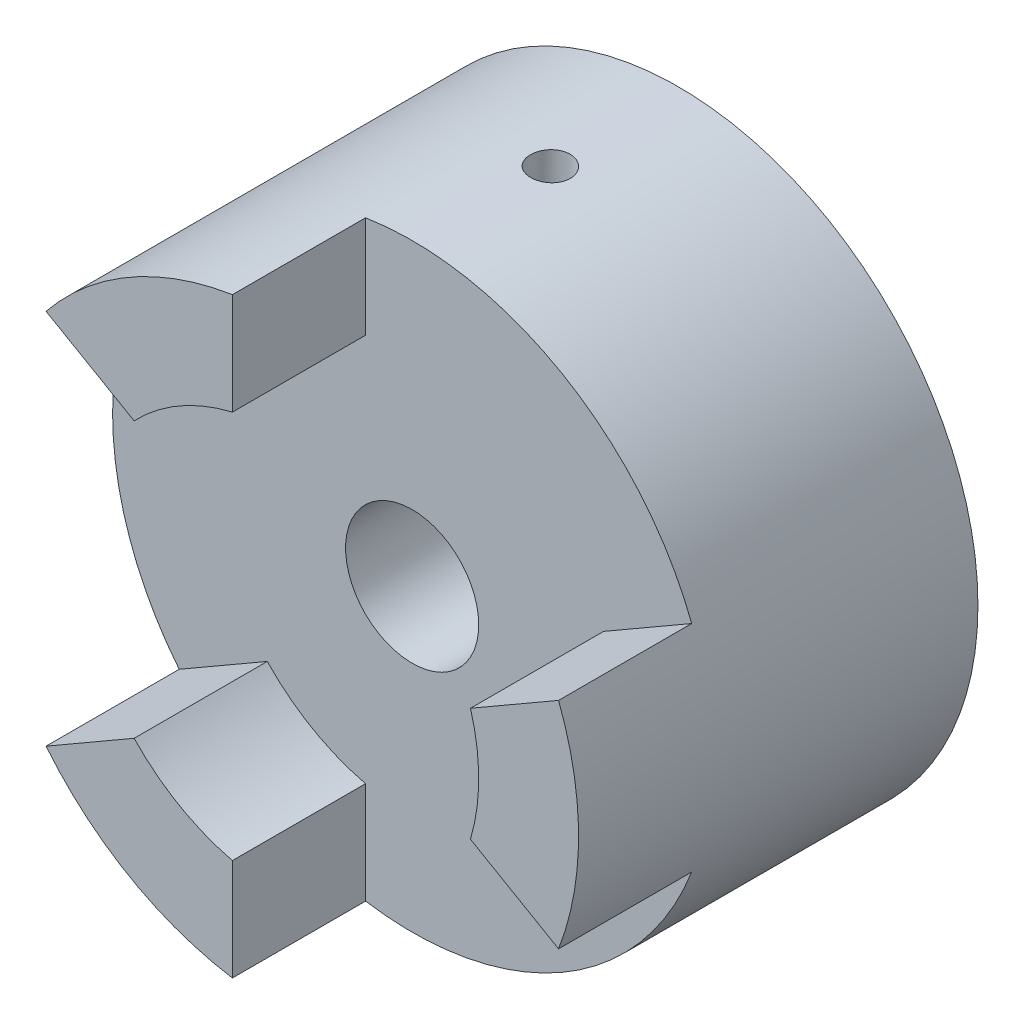
ISO-10303-21;
HEADER;
FILE_DESCRIPTION(('STEP AP214'),'2;1');
FILE_NAME('part.step','',(''),(''),'','','');
FILE_SCHEMA(('AUTOMOTIVE_DESIGN { 1 0 10303 214 1 1 1 1 }'));
ENDSEC;
DATA;
#1=APPLICATION_CONTEXT('core data for automotive mechanical design processes');
#2=APPLICATION_PROTOCOL_DEFINITION('international standard','automotive_design',2000,#1);
#3=PRODUCT_CONTEXT('',#1,'mechanical');
#4=PRODUCT('Part','Part','',(#3));
#5=PRODUCT_RELATED_PRODUCT_CATEGORY('part','',(#4));
#6=PRODUCT_DEFINITION_FORMATION('','',#4);
#7=PRODUCT_DEFINITION_CONTEXT('part definition',#1,'design');
#8=PRODUCT_DEFINITION('design','',#6,#7);
#9=PRODUCT_DEFINITION_SHAPE('','',#8);
#10=(LENGTH_UNIT() NAMED_UNIT(*) SI_UNIT(.MILLI.,.METRE.));
#11=(NAMED_UNIT(*) PLANE_ANGLE_UNIT() SI_UNIT($,.RADIAN.));
#12=(NAMED_UNIT(*) SI_UNIT($,.STERADIAN.) SOLID_ANGLE_UNIT());
#13=UNCERTAINTY_MEASURE_WITH_UNIT(LENGTH_MEASURE(1.E-05),#10,'distance_accuracy_value','');
#14=(GEOMETRIC_REPRESENTATION_CONTEXT(3) GLOBAL_UNCERTAINTY_ASSIGNED_CONTEXT((#13)) GLOBAL_UNIT_ASSIGNED_CONTEXT((#10,
#11,#12)) REPRESENTATION_CONTEXT('',''));
#15=CARTESIAN_POINT('',(0.,0.,0.));
#16=DIRECTION('',(0.,0.,1.));
#17=DIRECTION('',(1.,0.,0.));
#18=AXIS2_PLACEMENT_3D('',#15,#16,#17);
#19=CARTESIAN_POINT('',(0.,0.,20.));
#20=DIRECTION('',(0.,0.,1.));
#21=DIRECTION('',(1.,0.,0.));
#22=AXIS2_PLACEMENT_3D('',#19,#20,#21);
#23=PLANE('',#22);
#24=CARTESIAN_POINT('',(0.,0.,20.));
#25=DIRECTION('',(0.,0.,1.));
#26=DIRECTION('',(1.,0.,0.));
#27=AXIS2_PLACEMENT_3D('',#24,#25,#26);
#28=CIRCLE('',#27,5.);
#29=CARTESIAN_POINT('',(5.,0.,20.));
#30=VERTEX_POINT('',#29);
#31=EDGE_CURVE('E244',#30,#30,#28,.T.);
#32=ORIENTED_EDGE('',*,*,#31,.F.);
#33=EDGE_LOOP('',(#32));
#34=FACE_BOUND('',#33,.T.);
#35=CARTESIAN_POINT('',(0.,0.,20.));
#36=DIRECTION('',(0.,0.,-1.));
#37=DIRECTION('',(1.,0.,0.));
#38=AXIS2_PLACEMENT_3D('',#35,#36,#37);
#39=CIRCLE('',#38,15.);
#40=CARTESIAN_POINT('',(-3.5,-14.5859521458148,20.));
#41=VERTEX_POINT('',#40);
#42=CARTESIAN_POINT('',(-10.8818050966599,-10.3240649861528,20.));
#43=VERTEX_POINT('',#42);
#44=EDGE_CURVE('E53',#41,#43,#39,.T.);
#45=ORIENTED_EDGE('',*,*,#44,.F.);
#46=DIRECTION('',(0.,1.,0.));
#47=VECTOR('',#46,1.);
#48=CARTESIAN_POINT('',(-3.5,-14.5859521458148,20.));
#49=LINE('',#48,#47);
#50=CARTESIAN_POINT('',(-3.5,-22.2261107708929,20.));
#51=VERTEX_POINT('',#50);
#52=EDGE_CURVE('E402',#51,#41,#49,.T.);
#53=ORIENTED_EDGE('',*,*,#52,.F.);
#54=CARTESIAN_POINT('',(0.,0.,20.));
#55=DIRECTION('',(0.,0.,1.));
#56=DIRECTION('',(1.,0.,0.));
#57=AXIS2_PLACEMENT_3D('',#54,#55,#56);
#58=CIRCLE('',#57,22.5);
#59=CARTESIAN_POINT('',(20.9983765549201,-8.081966472201,20.));
#60=VERTEX_POINT('',#59);
#61=EDGE_CURVE('E39',#51,#60,#58,.T.);
#62=ORIENTED_EDGE('',*,*,#61,.T.);
#63=DIRECTION('',(0.866025403784436,-0.500000000000004,0.));
#64=VECTOR('',#63,1.);
#65=CARTESIAN_POINT('',(20.9983765549201,-8.081966472201,20.));
#66=LINE('',#65,#64);
#67=CARTESIAN_POINT('',(14.3818050966598,-4.26188715966194,20.));
#68=VERTEX_POINT('',#67);
#69=EDGE_CURVE('E161',#68,#60,#66,.T.);
#70=ORIENTED_EDGE('',*,*,#69,.F.);
#71=CARTESIAN_POINT('',(0.,0.,20.));
#72=DIRECTION('',(0.,0.,-1.));
#73=DIRECTION('',(1.,0.,0.));
#74=AXIS2_PLACEMENT_3D('',#71,#72,#73);
#75=CIRCLE('',#74,15.);
#76=CARTESIAN_POINT('',(14.3818050966598,4.26188715966176,20.));
#77=VERTEX_POINT('',#76);
#78=EDGE_CURVE('E151',#77,#68,#75,.T.);
#79=ORIENTED_EDGE('',*,*,#78,.F.);
#80=DIRECTION('',(-0.866025403784443,-0.499999999999992,0.));
#81=VECTOR('',#80,1.);
#82=CARTESIAN_POINT('',(14.3818050966598,4.26188715966176,20.));
#83=LINE('',#82,#81);
#84=CARTESIAN_POINT('',(20.9983765549202,8.08196647220072,20.));
#85=VERTEX_POINT('',#84);
#86=EDGE_CURVE('E149',#85,#77,#83,.T.);
#87=ORIENTED_EDGE('',*,*,#86,.F.);
#88=CARTESIAN_POINT('',(-3.50000000000001,22.2261107708929,20.));
#89=VERTEX_POINT('',#88);
#90=EDGE_CURVE('E216',#85,#89,#58,.T.);
#91=ORIENTED_EDGE('',*,*,#90,.T.);
#92=DIRECTION('',(0.,1.,0.));
#93=VECTOR('',#92,1.);
#94=CARTESIAN_POINT('',(-3.5,22.2261107708929,20.));
#95=LINE('',#94,#93);
#96=CARTESIAN_POINT('',(-3.5,14.5859521458148,20.));
#97=VERTEX_POINT('',#96);
#98=EDGE_CURVE('E194',#97,#89,#95,.T.);
#99=ORIENTED_EDGE('',*,*,#98,.F.);
#100=CARTESIAN_POINT('',(0.,0.,20.));
#101=DIRECTION('',(0.,0.,-1.));
#102=DIRECTION('',(1.,0.,0.));
#103=AXIS2_PLACEMENT_3D('',#100,#101,#102);
#104=CIRCLE('',#103,15.);
#105=CARTESIAN_POINT('',(-10.8818050966597,10.324064986153,20.));
#106=VERTEX_POINT('',#105);
#107=EDGE_CURVE('E180',#106,#97,#104,.T.);
#108=ORIENTED_EDGE('',*,*,#107,.F.);
#109=DIRECTION('',(0.866025403784436,-0.500000000000004,0.));
#110=VECTOR('',#109,1.);
#111=CARTESIAN_POINT('',(-17.4983765549201,14.1441442986921,20.));
#112=LINE('',#111,#110);
#113=CARTESIAN_POINT('',(-17.4983765549201,14.144144298692,20.));
#114=VERTEX_POINT('',#113);
#115=EDGE_CURVE('E185',#114,#106,#112,.T.);
#116=ORIENTED_EDGE('',*,*,#115,.F.);
#117=CARTESIAN_POINT('',(-17.4983765549203,-14.1441442986918,20.));
#118=VERTEX_POINT('',#117);
#119=EDGE_CURVE('E45',#114,#118,#58,.T.);
#120=ORIENTED_EDGE('',*,*,#119,.T.);
#121=DIRECTION('',(-0.866025403784443,-0.499999999999992,0.));
#122=VECTOR('',#121,1.);
#123=CARTESIAN_POINT('',(-17.4983765549203,-14.1441442986918,20.));
#124=LINE('',#123,#122);
#125=EDGE_CURVE('E58',#43,#118,#124,.T.);
#126=ORIENTED_EDGE('',*,*,#125,.F.);
#127=EDGE_LOOP('',(#45,#53,#62,#70,#79,#87,#91,#99,#108,#116,#120,#126));
#128=FACE_BOUND('',#127,.T.);
#129=ADVANCED_FACE('F34',(#34,#128),#23,.T.);
#130=CARTESIAN_POINT('',(0.,0.,20.));
#131=DIRECTION('',(0.,0.,-1.));
#132=DIRECTION('',(-1.,0.,0.));
#133=AXIS2_PLACEMENT_3D('',#130,#131,#132);
#134=CYLINDRICAL_SURFACE('',#133,22.5);
#135=CARTESIAN_POINT('',(-1.16795072214175,22.4696660213419,9.9509839765561));
#136=CARTESIAN_POINT('',(-1.16794701412822,22.4696666351266,9.86682882468708));
#137=CARTESIAN_POINT('',(-1.16083853462614,22.4700392018296,9.78261503637612));
#138=CARTESIAN_POINT('',(-1.13258449434566,22.471480697484,9.61651364954389));
#139=CARTESIAN_POINT('',(-1.11142267175415,22.4725504331371,9.5346288606282));
#140=CARTESIAN_POINT('',(-1.05567496758904,22.4752380311045,9.37561546316127));
#141=CARTESIAN_POINT('',(-1.02109626483874,22.4768556002368,9.29848433665232));
#142=CARTESIAN_POINT('',(-0.939510841472762,22.4804132200468,9.15113626091315));
#143=CARTESIAN_POINT('',(-0.892506933100566,22.4823531977157,9.08091775205354));
#144=CARTESIAN_POINT('',(-0.787321799091392,22.4862822653723,8.9492495333017));
#145=CARTESIAN_POINT('',(-0.729123980123893,22.488271424401,8.88781308018272));
#146=CARTESIAN_POINT('',(-0.603241089186681,22.4919998434333,8.77556647860183));
#147=CARTESIAN_POINT('',(-0.535555618423458,22.4937390929262,8.72475677703693));
#148=CARTESIAN_POINT('',(-0.392546510837813,22.4966890716028,8.63516458913433));
#149=CARTESIAN_POINT('',(-0.317215933429358,22.4978993151447,8.59639316367709));
#150=CARTESIAN_POINT('',(-0.161106583630494,22.4995584749486,8.53204891038463));
#151=CARTESIAN_POINT('',(-0.0803278761180135,22.500007400275,8.50647592540988));
#152=CARTESIAN_POINT('',(0.0842541461032171,22.4999924287302,8.46929151286395));
#153=CARTESIAN_POINT('',(0.168052740501643,22.499529900542,8.4576591934942));
#154=CARTESIAN_POINT('',(0.336402293717323,22.4976425119387,8.44862178180597));
#155=CARTESIAN_POINT('',(0.420953243062837,22.4962176636219,8.45121651062898));
#156=CARTESIAN_POINT('',(0.588266129708601,22.4924639826339,8.47054233443924));
#157=CARTESIAN_POINT('',(0.67103069653389,22.4901365901524,8.48725095768299));
#158=CARTESIAN_POINT('',(0.832565993292586,22.4847363612551,8.53429538928928));
#159=CARTESIAN_POINT('',(0.911336697020258,22.4816635199487,8.56463128705432));
#160=CARTESIAN_POINT('',(1.06272261164742,22.4750166272793,8.63809451797387));
#161=CARTESIAN_POINT('',(1.13533287297505,22.4714421789089,8.6812320136648));
#162=CARTESIAN_POINT('',(1.2722859030292,22.4641046836031,8.77906653524814));
#163=CARTESIAN_POINT('',(1.33662856545644,22.4603416342438,8.83376370974329));
#164=CARTESIAN_POINT('',(1.45535453244866,22.4529618562286,8.95329180612418));
#165=CARTESIAN_POINT('',(1.50971821721403,22.449345426488,9.01814223651269));
#166=CARTESIAN_POINT('',(1.60679530484671,22.4426064521477,9.15606769541081));
#167=CARTESIAN_POINT('',(1.64950870236193,22.439483907775,9.22914272769877));
#168=CARTESIAN_POINT('',(1.7220745704774,22.4340319588832,9.38145576222379));
#169=CARTESIAN_POINT('',(1.75192618133141,22.4317026073872,9.46069417603434));
#170=CARTESIAN_POINT('',(1.79790975507206,22.4280640531212,9.62307881670943));
#171=CARTESIAN_POINT('',(1.81404190173043,22.4267548366865,9.7062249912139));
#172=CARTESIAN_POINT('',(1.83210546711131,22.4252864697945,9.87389368251136));
#173=CARTESIAN_POINT('',(1.83406414738777,22.4251251115319,9.95841324354472));
#174=CARTESIAN_POINT('',(1.82379660597111,22.4259624418472,10.1265800340995));
#175=CARTESIAN_POINT('',(1.81157046841159,22.4269611235448,10.2102272687919));
#176=CARTESIAN_POINT('',(1.77330198524295,22.430019264112,10.3741975858724));
#177=CARTESIAN_POINT('',(1.74727222536644,22.432077756628,10.4545236246261));
#178=CARTESIAN_POINT('',(1.68214605935868,22.4370551772429,10.60966269689));
#179=CARTESIAN_POINT('',(1.64304951843054,22.4399741142182,10.6844756735177));
#180=CARTESIAN_POINT('',(1.5528271333128,22.4463976750895,10.8265902326363));
#181=CARTESIAN_POINT('',(1.50168303140065,22.4499031855614,10.8938801836915));
#182=CARTESIAN_POINT('',(1.38884040962061,22.4571661269891,11.0189213375547));
#183=CARTESIAN_POINT('',(1.3271417726129,22.4609235607405,11.0766724344814));
#184=CARTESIAN_POINT('',(1.19482048170147,22.4683509312009,11.1810888947149));
#185=CARTESIAN_POINT('',(1.1241838714648,22.4720207201659,11.2277365849532));
#186=CARTESIAN_POINT('',(0.976058442943612,22.4789412520019,11.3085010832813));
#187=CARTESIAN_POINT('',(0.89856967163721,22.4821919977453,11.3426179772733));
#188=CARTESIAN_POINT('',(0.739001568444851,22.4880021362221,11.3973217571046));
#189=CARTESIAN_POINT('',(0.656926076696509,22.4905620971359,11.4179197825061));
#190=CARTESIAN_POINT('',(0.49045958171309,22.4948078152173,11.445037570028));
#191=CARTESIAN_POINT('',(0.40606860499338,22.4964935823911,11.4515574932931));
#192=CARTESIAN_POINT('',(0.237540917170963,22.4989035911875,11.4503323899263));
#193=CARTESIAN_POINT('',(0.153404030342545,22.4996296909851,11.4426150002337));
#194=CARTESIAN_POINT('',(-0.0123898446146695,22.5001493640251,11.4131917004924));
#195=CARTESIAN_POINT('',(-0.094046828527573,22.4999429356823,11.3914857666642));
#196=CARTESIAN_POINT('',(-0.252564896325961,22.4987221590962,11.3347079254833));
#197=CARTESIAN_POINT('',(-0.329426048193699,22.4977078223081,11.2996362076445));
#198=CARTESIAN_POINT('',(-0.476181328642586,22.4950804526772,11.2171260186757));
#199=CARTESIAN_POINT('',(-0.546075625279928,22.4934674342804,11.1696878459523));
#200=CARTESIAN_POINT('',(-0.677050473510534,22.4899068565662,11.0636887007921));
#201=CARTESIAN_POINT('',(-0.738114734161111,22.4879586930601,11.0051076197651));
#202=CARTESIAN_POINT('',(-0.849564286877072,22.4840245335145,10.8785150339242));
#203=CARTESIAN_POINT('',(-0.899946966889859,22.4820385283505,10.8105012291612));
#204=CARTESIAN_POINT('',(-0.9886424430826,22.47831322808,10.666886676364));
#205=CARTESIAN_POINT('',(-1.02693884290122,22.4765742698621,10.5912758037275));
#206=CARTESIAN_POINT('',(-1.09023738754139,22.47359330319,10.4347413302532));
#207=CARTESIAN_POINT('',(-1.11525505244659,22.4723507150045,10.3538240563899));
#208=CARTESIAN_POINT('',(-1.14480459317688,22.4708599339827,10.2188429666264));
#209=CARTESIAN_POINT('',(-1.15347308513632,22.4704146367155,10.165650945378));
#210=CARTESIAN_POINT('',(-1.16504733114898,22.4698174842866,10.0586419413207));
#211=CARTESIAN_POINT('',(-1.16795309446345,22.4696656286533,10.0048249595162));
#212=CARTESIAN_POINT('',(-1.16795072214175,22.4696660213419,9.9509839765561));
#213=B_SPLINE_CURVE_WITH_KNOTS('',3,(#135,#136,#137,#138,#139,#140,#141,#142,#143,#144,#145,
#146,#147,#148,#149,#150,#151,#152,#153,#154,#155,#156,#157,#158,#159,#160,#161,#162,#163,#164,
#165,#166,#167,#168,#169,#170,#171,#172,#173,#174,#175,#176,#177,#178,#179,#180,#181,#182,#183,
#184,#185,#186,#187,#188,#189,#190,#191,#192,#193,#194,#195,#196,#197,#198,#199,#200,#201,#202,
#203,#204,#205,#206,#207,#208,#209,#210,#211,#212),.UNSPECIFIED.,.T.,.F.,(4,2,2,2,2,2,2,2,2,2,2,
2,2,2,2,2,2,2,2,2,2,2,2,2,2,2,2,2,2,2,2,2,2,2,2,2,2,2,4),(0.,0.252268897261408,
0.504830217080159,0.757256587612157,1.0096258743797,1.26237218560875,1.51512912368541,
1.76811761462682,2.02110309343897,2.27370896646024,2.52631166379775,2.7785129306925,
3.03071585219184,3.28311952276676,3.53552643825509,3.78842441965064,4.04132251722657,
4.2942375171565,4.54714912924566,4.7995741560111,5.05199768558994,5.30419145760964,
5.55638783133998,5.80896888837173,6.06155274886383,6.31453599310349,6.567517503036,
6.82029029333925,7.07306019026671,7.32533993592649,7.57762011044376,7.82989670800653,
8.0821672186178,8.33489737367269,8.58768925975639,8.84082262604519,9.09365947683888,
9.25505693053532,9.41645412485044),.UNSPECIFIED.);
#214=CARTESIAN_POINT('',(-1.16795072214175,22.4696660213419,9.9509839765561));
#215=VERTEX_POINT('',#214);
#216=EDGE_CURVE('E11',#215,#215,#213,.T.);
#217=ORIENTED_EDGE('',*,*,#216,.T.);
#218=EDGE_LOOP('',(#217));
#219=FACE_BOUND('',#218,.T.);
#220=ORIENTED_EDGE('',*,*,#119,.F.);
#221=DIRECTION('',(0.,0.,-1.));
#222=VECTOR('',#221,1.);
#223=CARTESIAN_POINT('',(-17.4983765549201,14.1441442986921,30.));
#224=LINE('',#223,#222);
#225=CARTESIAN_POINT('',(-17.4983765549201,14.1441442986921,30.));
#226=VERTEX_POINT('',#225);
#227=EDGE_CURVE('E206',#226,#114,#224,.T.);
#228=ORIENTED_EDGE('',*,*,#227,.F.);
#229=CARTESIAN_POINT('',(0.,0.,30.));
#230=DIRECTION('',(0.,0.,1.));
#231=DIRECTION('',(1.,0.,0.));
#232=AXIS2_PLACEMENT_3D('',#229,#230,#231);
#233=CIRCLE('',#232,22.5);
#234=CARTESIAN_POINT('',(-3.50000000000001,22.2261107708929,30.));
#235=VERTEX_POINT('',#234);
#236=EDGE_CURVE('E187',#235,#226,#233,.T.);
#237=ORIENTED_EDGE('',*,*,#236,.F.);
#238=DIRECTION('',(0.,0.,-1.));
#239=VECTOR('',#238,1.);
#240=CARTESIAN_POINT('',(-3.50000000000001,22.2261107708929,30.));
#241=LINE('',#240,#239);
#242=EDGE_CURVE('E202',#235,#89,#241,.T.);
#243=ORIENTED_EDGE('',*,*,#242,.T.);
#244=ORIENTED_EDGE('',*,*,#90,.F.);
#245=DIRECTION('',(0.,0.,-1.));
#246=VECTOR('',#245,1.);
#247=CARTESIAN_POINT('',(20.9983765549202,8.08196647220072,30.));
#248=LINE('',#247,#246);
#249=CARTESIAN_POINT('',(20.9983765549202,8.08196647220072,30.));
#250=VERTEX_POINT('',#249);
#251=EDGE_CURVE('E178',#250,#85,#248,.T.);
#252=ORIENTED_EDGE('',*,*,#251,.F.);
#253=CARTESIAN_POINT('',(0.,0.,30.));
#254=DIRECTION('',(0.,0.,1.));
#255=DIRECTION('',(1.,0.,0.));
#256=AXIS2_PLACEMENT_3D('',#253,#254,#255);
#257=CIRCLE('',#256,22.5);
#258=CARTESIAN_POINT('',(20.9983765549201,-8.081966472201,30.));
#259=VERTEX_POINT('',#258);
#260=EDGE_CURVE('E157',#259,#250,#257,.T.);
#261=ORIENTED_EDGE('',*,*,#260,.F.);
#262=DIRECTION('',(0.,0.,-1.));
#263=VECTOR('',#262,1.);
#264=CARTESIAN_POINT('',(20.9983765549201,-8.081966472201,30.));
#265=LINE('',#264,#263);
#266=EDGE_CURVE('E166',#259,#60,#265,.T.);
#267=ORIENTED_EDGE('',*,*,#266,.T.);
#268=ORIENTED_EDGE('',*,*,#61,.F.);
#269=DIRECTION('',(0.,0.,-1.));
#270=VECTOR('',#269,1.);
#271=CARTESIAN_POINT('',(-3.5,-22.2261107708929,30.));
#272=LINE('',#271,#270);
#273=CARTESIAN_POINT('',(-3.5,-22.2261107708929,30.));
#274=VERTEX_POINT('',#273);
#275=EDGE_CURVE('E130',#274,#51,#272,.T.);
#276=ORIENTED_EDGE('',*,*,#275,.F.);
#277=CARTESIAN_POINT('',(0.,0.,30.));
#278=DIRECTION('',(0.,0.,1.));
#279=DIRECTION('',(1.,0.,0.));
#280=AXIS2_PLACEMENT_3D('',#277,#278,#279);
#281=CIRCLE('',#280,22.5);
#282=CARTESIAN_POINT('',(-17.4983765549203,-14.1441442986918,30.));
#283=VERTEX_POINT('',#282);
#284=EDGE_CURVE('E136',#283,#274,#281,.T.);
#285=ORIENTED_EDGE('',*,*,#284,.F.);
#286=DIRECTION('',(0.,0.,-1.));
#287=VECTOR('',#286,1.);
#288=CARTESIAN_POINT('',(-17.4983765549203,-14.1441442986918,30.));
#289=LINE('',#288,#287);
#290=EDGE_CURVE('E394',#283,#118,#289,.T.);
#291=ORIENTED_EDGE('',*,*,#290,.T.);
#292=EDGE_LOOP('',(#220,#228,#237,#243,#244,#252,#261,#267,#268,#276,#285,#291));
#293=FACE_BOUND('',#292,.T.);
#294=CARTESIAN_POINT('',(0.,0.,0.));
#295=DIRECTION('',(0.,0.,1.));
#296=DIRECTION('',(1.,0.,0.));
#297=AXIS2_PLACEMENT_3D('',#294,#295,#296);
#298=CIRCLE('',#297,22.5);
#299=CARTESIAN_POINT('',(22.5,0.,0.));
#300=VERTEX_POINT('',#299);
#301=EDGE_CURVE('E217',#300,#300,#298,.T.);
#302=ORIENTED_EDGE('',*,*,#301,.T.);
#303=EDGE_LOOP('',(#302));
#304=FACE_BOUND('',#303,.T.);
#305=ADVANCED_FACE('F36',(#219,#293,#304),#134,.T.);
#306=CARTESIAN_POINT('',(0.,0.,0.));
#307=DIRECTION('',(0.,0.,1.));
#308=DIRECTION('',(1.,0.,0.));
#309=AXIS2_PLACEMENT_3D('',#306,#307,#308);
#310=PLANE('',#309);
#311=CARTESIAN_POINT('',(0.,0.,0.));
#312=DIRECTION('',(0.,0.,1.));
#313=DIRECTION('',(1.,0.,0.));
#314=AXIS2_PLACEMENT_3D('',#311,#312,#313);
#315=CIRCLE('',#314,5.);
#316=CARTESIAN_POINT('',(5.,0.,0.));
#317=VERTEX_POINT('',#316);
#318=EDGE_CURVE('E246',#317,#317,#315,.F.);
#319=ORIENTED_EDGE('',*,*,#318,.F.);
#320=EDGE_LOOP('',(#319));
#321=FACE_BOUND('',#320,.T.);
#322=ORIENTED_EDGE('',*,*,#301,.F.);
#323=EDGE_LOOP('',(#322));
#324=FACE_BOUND('',#323,.T.);
#325=ADVANCED_FACE('F253',(#321,#324),#310,.F.);
#326=CARTESIAN_POINT('',(0.,0.,-0.001000000000001));
#327=DIRECTION('',(0.,0.,1.));
#328=DIRECTION('',(1.,0.,0.));
#329=AXIS2_PLACEMENT_3D('',#326,#327,#328);
#330=CYLINDRICAL_SURFACE('',#329,5.);
#331=CARTESIAN_POINT('',(-1.42932400055375,4.79134979952842,9.9509839765561));
#332=CARTESIAN_POINT('',(-1.42932296443467,4.79135063448742,10.0331785244985));
#333=CARTESIAN_POINT('',(-1.422514069942,4.7933972446987,10.1153832007001));
#334=CARTESIAN_POINT('',(-1.39553134300934,4.80132109648802,10.277389226148));
#335=CARTESIAN_POINT('',(-1.37535304496598,4.80719961797761,10.3571897630576));
#336=CARTESIAN_POINT('',(-1.32238618351659,4.82203727176339,10.5120187048278));
#337=CARTESIAN_POINT('',(-1.28961859373441,4.83099127771981,10.5870548061892));
#338=CARTESIAN_POINT('',(-1.21248381726078,4.85092400409659,10.7306059105514));
#339=CARTESIAN_POINT('',(-1.16811489409703,4.86190302754638,10.7991199352405));
#340=CARTESIAN_POINT('',(-1.0675477744788,4.88498438250552,10.9298503671335));
#341=CARTESIAN_POINT('',(-1.0110468747201,4.89710989632544,10.9918298745024));
#342=CARTESIAN_POINT('',(-0.888487115072368,4.92082118005726,11.1056219278786));
#343=CARTESIAN_POINT('',(-0.822427028478875,4.93240688044371,11.157433167006));
#344=CARTESIAN_POINT('',(-0.680950025195329,4.95394023252572,11.2504466763894));
#345=CARTESIAN_POINT('',(-0.605367863556551,4.96384905552715,11.2914074009989));
#346=CARTESIAN_POINT('',(-0.448044957831161,4.98051223286052,11.3599712355988));
#347=CARTESIAN_POINT('',(-0.366305546360055,4.98726726750278,11.3875772264135));
#348=CARTESIAN_POINT('',(-0.201479374232686,4.99660102683323,11.4278639776466));
#349=CARTESIAN_POINT('',(-0.118498045762689,4.99929369281833,11.4409491042088));
#350=CARTESIAN_POINT('',(0.0485070418418744,5.00046136727325,11.4531013012025));
#351=CARTESIAN_POINT('',(0.132530578321246,4.99893726166618,11.4521713159581));
#352=CARTESIAN_POINT('',(0.296399951332224,4.9918597630997,11.4365911080131));
#353=CARTESIAN_POINT('',(0.376293615269112,4.98643623839057,11.4223787827462));
#354=CARTESIAN_POINT('',(0.532452976751742,4.97218714201174,11.3813526405618));
#355=CARTESIAN_POINT('',(0.608718444207739,4.96336135490264,11.3545380256134));
#356=CARTESIAN_POINT('',(0.756504219033951,4.94300871447356,11.2887719531375));
#357=CARTESIAN_POINT('',(0.827958913049302,4.93145159874522,11.2496827737488));
#358=CARTESIAN_POINT('',(0.96340874615843,4.90679021133723,11.1605861241279));
#359=CARTESIAN_POINT('',(1.02740210998043,4.89368557294284,11.1105760635926));
#360=CARTESIAN_POINT('',(1.14873162436376,4.86666523213691,10.9987862258045));
#361=CARTESIAN_POINT('',(1.20571605546711,4.85273773775434,10.9366270575264));
#362=CARTESIAN_POINT('',(1.30856428490652,4.8260222226985,10.803473958666));
#363=CARTESIAN_POINT('',(1.35442697810153,4.81323431534312,10.7324791511669));
#364=CARTESIAN_POINT('',(1.43411041449273,4.79010153817037,10.5827445073071));
#365=CARTESIAN_POINT('',(1.4678114682443,4.77978127092383,10.5039369306932));
#366=CARTESIAN_POINT('',(1.52141287306159,4.76299284654933,10.3413767681105));
#367=CARTESIAN_POINT('',(1.54131772627952,4.75652343285911,10.2576258050215));
#368=CARTESIAN_POINT('',(1.56611632224678,4.74841495672667,10.0909016158168));
#369=CARTESIAN_POINT('',(1.57154191657337,4.74660484175629,10.0080157526621));
#370=CARTESIAN_POINT('',(1.56871543902162,4.74753986645395,9.84251107654623));
#371=CARTESIAN_POINT('',(1.56046528176053,4.75028436847167,9.75989222782525));
#372=CARTESIAN_POINT('',(1.53099165063931,4.7598625581268,9.59949559858523));
#373=CARTESIAN_POINT('',(1.51011077430168,4.76658816190334,9.52164781229257));
#374=CARTESIAN_POINT('',(1.45635788792864,4.78328428135765,9.37058228574118));
#375=CARTESIAN_POINT('',(1.42348402644975,4.79325529802753,9.29736526241553));
#376=CARTESIAN_POINT('',(1.34565780909077,4.81569127858406,9.15546651248397));
#377=CARTESIAN_POINT('',(1.30040495091017,4.82821599653718,9.08695925557031));
#378=CARTESIAN_POINT('',(1.19944661599221,4.85428069293403,8.95834587037529));
#379=CARTESIAN_POINT('',(1.14373863739783,4.86782091391589,8.89824175894331));
#380=CARTESIAN_POINT('',(1.02093235225642,4.89507846894722,8.78580357074136));
#381=CARTESIAN_POINT('',(0.953483516674357,4.90878320140967,8.73384834756912));
#382=CARTESIAN_POINT('',(0.810497398955897,4.9344058819619,8.64201727552835));
#383=CARTESIAN_POINT('',(0.734960518759725,4.94632391877202,8.60214082677464));
#384=CARTESIAN_POINT('',(0.578428368637948,4.9670513941462,8.53598394598781));
#385=CARTESIAN_POINT('',(0.497479213717913,4.97588388845392,8.50960196039713));
#386=CARTESIAN_POINT('',(0.331970090537054,4.98965743444545,8.47092305766568));
#387=CARTESIAN_POINT('',(0.247411162563737,4.99459959939399,8.45862211060768));
#388=CARTESIAN_POINT('',(0.080578008585428,5.00002062862095,8.4487609325016));
#389=CARTESIAN_POINT('',(-0.00165879935132662,5.00066404465176,8.45065128114827));
#390=CARTESIAN_POINT('',(-0.1646509927773,4.99795291237101,8.46780560905522));
#391=CARTESIAN_POINT('',(-0.245406461997473,4.99459859073839,8.48306883003654));
#392=CARTESIAN_POINT('',(-0.402293598014275,4.9844036241748,8.52619563795573));
#393=CARTESIAN_POINT('',(-0.478465604846828,4.97760080353909,8.55392215720511));
#394=CARTESIAN_POINT('',(-0.625156726331362,4.9613135110757,8.62106589106329));
#395=CARTESIAN_POINT('',(-0.695674909604077,4.95182859857548,8.66048502684229));
#396=CARTESIAN_POINT('',(-0.831497974724446,4.93087082685218,8.75135743398614));
#397=CARTESIAN_POINT('',(-0.896563846830565,4.91934406965021,8.80315540655687));
#398=CARTESIAN_POINT('',(-1.01727228510547,4.89580907559257,8.9166943648889));
#399=CARTESIAN_POINT('',(-1.07291212765864,4.88380070081067,8.97843821445425));
#400=CARTESIAN_POINT('',(-1.17483948093555,4.86030600083987,9.11232475486661));
#401=CARTESIAN_POINT('',(-1.22079882562873,4.84884590213079,9.18472252994654));
#402=CARTESIAN_POINT('',(-1.29980719863466,4.82826860994361,9.33653915071712));
#403=CARTESIAN_POINT('',(-1.33286243046854,4.81915029140159,9.41595460015729));
#404=CARTESIAN_POINT('',(-1.38213298674558,4.80523583586186,9.57072440816237));
#405=CARTESIAN_POINT('',(-1.39978030734065,4.80007954010927,9.64559262348709));
#406=CARTESIAN_POINT('',(-1.42337512585055,4.7931364693721,9.79729919905187));
#407=CARTESIAN_POINT('',(-1.42932496926096,4.79134901889342,9.87413716120134));
#408=CARTESIAN_POINT('',(-1.42932400055375,4.79134979952842,9.9509839765561));
#409=B_SPLINE_CURVE_WITH_KNOTS('',3,(#331,#332,#333,#334,#335,#336,#337,#338,#339,#340,#341,
#342,#343,#344,#345,#346,#347,#348,#349,#350,#351,#352,#353,#354,#355,#356,#357,#358,#359,#360,
#361,#362,#363,#364,#365,#366,#367,#368,#369,#370,#371,#372,#373,#374,#375,#376,#377,#378,#379,
#380,#381,#382,#383,#384,#385,#386,#387,#388,#389,#390,#391,#392,#393,#394,#395,#396,#397,#398,
#399,#400,#401,#402,#403,#404,#405,#406,#407,#408),.UNSPECIFIED.,.T.,.F.,(4,2,2,2,2,2,2,2,2,2,2,
2,2,2,2,2,2,2,2,2,2,2,2,2,2,2,2,2,2,2,2,2,2,2,2,2,2,2,4),(0.,0.246300165915542,
0.492682641688997,0.738656414466192,0.984667025370099,1.23773150007983,1.49082847871272,
1.74915939273644,2.00743455587876,2.25832140149557,2.50915554101439,2.75200125990879,
2.99486235890375,3.24055209335675,3.48630016590829,3.74152147023276,3.99676812491861,
4.25446238246264,4.51207250628409,4.76008080790307,5.00805439107385,5.24958594938814,
5.49115481045785,5.73920731809386,5.9873192592892,6.24479506100599,6.50225807324199,
6.75775391814322,7.01317662321679,7.25876303911216,7.50433553047751,7.74727096872215,
7.99024634491374,8.24099627054484,8.49181852629886,8.75011639669142,9.0082899396394,
9.23861153857443,9.46888695033555),.UNSPECIFIED.);
#410=CARTESIAN_POINT('',(-1.42932400055375,4.79134979952842,9.9509839765561));
#411=VERTEX_POINT('',#410);
#412=EDGE_CURVE('E239',#411,#411,#409,.T.);
#413=ORIENTED_EDGE('',*,*,#412,.T.);
#414=EDGE_LOOP('',(#413));
#415=FACE_BOUND('',#414,.T.);
#416=ORIENTED_EDGE('',*,*,#31,.T.);
#417=EDGE_LOOP('',(#416));
#418=FACE_BOUND('',#417,.T.);
#419=ORIENTED_EDGE('',*,*,#318,.T.);
#420=EDGE_LOOP('',(#419));
#421=FACE_BOUND('',#420,.T.);
#422=ADVANCED_FACE('F232',(#415,#418,#421),#330,.F.);
#423=CARTESIAN_POINT('',(0.332625348918888,22.4975412073688,9.9509839765561));
#424=DIRECTION('',(0.0147833488408394,0.999890720327502,0.));
#425=DIRECTION('',(-0.999890720327502,0.0147833488408394,0.));
#426=AXIS2_PLACEMENT_3D('',#423,#424,#425);
#427=CYLINDRICAL_SURFACE('',#426,1.49999999999999);
#428=ORIENTED_EDGE('',*,*,#216,.F.);
#429=EDGE_LOOP('',(#428));
#430=FACE_BOUND('',#429,.T.);
#431=ORIENTED_EDGE('',*,*,#412,.F.);
#432=EDGE_LOOP('',(#431));
#433=FACE_BOUND('',#432,.T.);
#434=ADVANCED_FACE('F226',(#430,#433),#427,.F.);
#435=CARTESIAN_POINT('',(0.,0.,30.));
#436=DIRECTION('',(0.,0.,-1.));
#437=DIRECTION('',(-1.,0.,0.));
#438=AXIS2_PLACEMENT_3D('',#435,#436,#437);
#439=CYLINDRICAL_SURFACE('',#438,15.);
#440=ORIENTED_EDGE('',*,*,#107,.T.);
#441=DIRECTION('',(0.,0.,-1.));
#442=VECTOR('',#441,1.);
#443=CARTESIAN_POINT('',(-3.5,14.5859521458148,30.));
#444=LINE('',#443,#442);
#445=CARTESIAN_POINT('',(-3.5,14.5859521458148,30.));
#446=VERTEX_POINT('',#445);
#447=EDGE_CURVE('E205',#446,#97,#444,.T.);
#448=ORIENTED_EDGE('',*,*,#447,.F.);
#449=CARTESIAN_POINT('',(0.,0.,30.));
#450=DIRECTION('',(0.,0.,-1.));
#451=DIRECTION('',(1.,0.,0.));
#452=AXIS2_PLACEMENT_3D('',#449,#450,#451);
#453=CIRCLE('',#452,15.);
#454=CARTESIAN_POINT('',(-10.8818050966597,10.324064986153,30.));
#455=VERTEX_POINT('',#454);
#456=EDGE_CURVE('E181',#455,#446,#453,.T.);
#457=ORIENTED_EDGE('',*,*,#456,.F.);
#458=DIRECTION('',(0.,0.,-1.));
#459=VECTOR('',#458,1.);
#460=CARTESIAN_POINT('',(-10.8818050966597,10.324064986153,30.));
#461=LINE('',#460,#459);
#462=EDGE_CURVE('E191',#455,#106,#461,.T.);
#463=ORIENTED_EDGE('',*,*,#462,.T.);
#464=EDGE_LOOP('',(#440,#448,#457,#463));
#465=FACE_BOUND('',#464,.T.);
#466=ADVANCED_FACE('F231',(#465),#439,.F.);
#467=CARTESIAN_POINT('',(-3.5,22.2261107708929,30.));
#468=DIRECTION('',(-1.,0.,0.));
#469=DIRECTION('',(0.,-1.,0.));
#470=AXIS2_PLACEMENT_3D('',#467,#468,#469);
#471=PLANE('',#470);
#472=ORIENTED_EDGE('',*,*,#98,.T.);
#473=ORIENTED_EDGE('',*,*,#242,.F.);
#474=DIRECTION('',(0.,1.,0.));
#475=VECTOR('',#474,1.);
#476=CARTESIAN_POINT('',(-3.5,22.2261107708929,30.));
#477=LINE('',#476,#475);
#478=EDGE_CURVE('E184',#446,#235,#477,.T.);
#479=ORIENTED_EDGE('',*,*,#478,.F.);
#480=ORIENTED_EDGE('',*,*,#447,.T.);
#481=EDGE_LOOP('',(#472,#473,#479,#480));
#482=FACE_BOUND('',#481,.T.);
#483=ADVANCED_FACE('F285',(#482),#471,.F.);
#484=CARTESIAN_POINT('',(-17.4983765549201,14.1441442986921,30.));
#485=DIRECTION('',(0.500000000000004,0.866025403784436,0.));
#486=DIRECTION('',(-0.866025403784436,0.500000000000004,0.));
#487=AXIS2_PLACEMENT_3D('',#484,#485,#486);
#488=PLANE('',#487);
#489=ORIENTED_EDGE('',*,*,#115,.T.);
#490=ORIENTED_EDGE('',*,*,#462,.F.);
#491=DIRECTION('',(0.866025403784436,-0.500000000000004,0.));
#492=VECTOR('',#491,1.);
#493=CARTESIAN_POINT('',(-17.4983765549201,14.1441442986921,30.));
#494=LINE('',#493,#492);
#495=EDGE_CURVE('E189',#226,#455,#494,.T.);
#496=ORIENTED_EDGE('',*,*,#495,.F.);
#497=ORIENTED_EDGE('',*,*,#227,.T.);
#498=EDGE_LOOP('',(#489,#490,#496,#497));
#499=FACE_BOUND('',#498,.T.);
#500=ADVANCED_FACE('F294',(#499),#488,.F.);
#501=CARTESIAN_POINT('',(0.,0.,30.));
#502=DIRECTION('',(0.,0.,1.));
#503=DIRECTION('',(1.,0.,0.));
#504=AXIS2_PLACEMENT_3D('',#501,#502,#503);
#505=PLANE('',#504);
#506=ORIENTED_EDGE('',*,*,#456,.T.);
#507=ORIENTED_EDGE('',*,*,#478,.T.);
#508=ORIENTED_EDGE('',*,*,#236,.T.);
#509=ORIENTED_EDGE('',*,*,#495,.T.);
#510=EDGE_LOOP('',(#506,#507,#508,#509));
#511=FACE_BOUND('',#510,.T.);
#512=ADVANCED_FACE('F303',(#511),#505,.T.);
#513=CARTESIAN_POINT('',(14.3818050966598,4.26188715966176,30.));
#514=DIRECTION('',(0.499999999999992,-0.866025403784443,0.));
#515=DIRECTION('',(0.866025403784443,0.499999999999992,0.));
#516=AXIS2_PLACEMENT_3D('',#513,#514,#515);
#517=PLANE('',#516);
#518=ORIENTED_EDGE('',*,*,#86,.T.);
#519=DIRECTION('',(0.,0.,-1.));
#520=VECTOR('',#519,1.);
#521=CARTESIAN_POINT('',(14.3818050966598,4.26188715966176,30.));
#522=LINE('',#521,#520);
#523=CARTESIAN_POINT('',(14.3818050966598,4.26188715966176,30.));
#524=VERTEX_POINT('',#523);
#525=EDGE_CURVE('E175',#524,#77,#522,.T.);
#526=ORIENTED_EDGE('',*,*,#525,.F.);
#527=DIRECTION('',(-0.866025403784443,-0.499999999999992,0.));
#528=VECTOR('',#527,1.);
#529=CARTESIAN_POINT('',(14.3818050966598,4.26188715966176,30.));
#530=LINE('',#529,#528);
#531=EDGE_CURVE('E160',#250,#524,#530,.T.);
#532=ORIENTED_EDGE('',*,*,#531,.F.);
#533=ORIENTED_EDGE('',*,*,#251,.T.);
#534=EDGE_LOOP('',(#518,#526,#532,#533));
#535=FACE_BOUND('',#534,.T.);
#536=ADVANCED_FACE('F313',(#535),#517,.F.);
#537=CARTESIAN_POINT('',(0.,0.,30.));
#538=DIRECTION('',(0.,0.,-1.));
#539=DIRECTION('',(-1.,0.,0.));
#540=AXIS2_PLACEMENT_3D('',#537,#538,#539);
#541=CYLINDRICAL_SURFACE('',#540,15.);
#542=ORIENTED_EDGE('',*,*,#78,.T.);
#543=DIRECTION('',(0.,0.,-1.));
#544=VECTOR('',#543,1.);
#545=CARTESIAN_POINT('',(14.3818050966598,-4.26188715966194,30.));
#546=LINE('',#545,#544);
#547=CARTESIAN_POINT('',(14.3818050966598,-4.26188715966194,30.));
#548=VERTEX_POINT('',#547);
#549=EDGE_CURVE('E173',#548,#68,#546,.T.);
#550=ORIENTED_EDGE('',*,*,#549,.F.);
#551=CARTESIAN_POINT('',(0.,0.,30.));
#552=DIRECTION('',(0.,0.,-1.));
#553=DIRECTION('',(1.,0.,0.));
#554=AXIS2_PLACEMENT_3D('',#551,#552,#553);
#555=CIRCLE('',#554,15.);
#556=EDGE_CURVE('E163',#524,#548,#555,.T.);
#557=ORIENTED_EDGE('',*,*,#556,.F.);
#558=ORIENTED_EDGE('',*,*,#525,.T.);
#559=EDGE_LOOP('',(#542,#550,#557,#558));
#560=FACE_BOUND('',#559,.T.);
#561=ADVANCED_FACE('F323',(#560),#541,.F.);
#562=CARTESIAN_POINT('',(20.9983765549201,-8.081966472201,30.));
#563=DIRECTION('',(0.500000000000004,0.866025403784436,0.));
#564=DIRECTION('',(-0.866025403784436,0.500000000000004,0.));
#565=AXIS2_PLACEMENT_3D('',#562,#563,#564);
#566=PLANE('',#565);
#567=ORIENTED_EDGE('',*,*,#69,.T.);
#568=ORIENTED_EDGE('',*,*,#266,.F.);
#569=DIRECTION('',(0.866025403784436,-0.500000000000004,0.));
#570=VECTOR('',#569,1.);
#571=CARTESIAN_POINT('',(20.9983765549201,-8.081966472201,30.));
#572=LINE('',#571,#570);
#573=EDGE_CURVE('E165',#548,#259,#572,.T.);
#574=ORIENTED_EDGE('',*,*,#573,.F.);
#575=ORIENTED_EDGE('',*,*,#549,.T.);
#576=EDGE_LOOP('',(#567,#568,#574,#575));
#577=FACE_BOUND('',#576,.T.);
#578=ADVANCED_FACE('F333',(#577),#566,.F.);
#579=CARTESIAN_POINT('',(0.,0.,30.));
#580=DIRECTION('',(0.,0.,1.));
#581=DIRECTION('',(1.,0.,0.));
#582=AXIS2_PLACEMENT_3D('',#579,#580,#581);
#583=PLANE('',#582);
#584=ORIENTED_EDGE('',*,*,#260,.T.);
#585=ORIENTED_EDGE('',*,*,#531,.T.);
#586=ORIENTED_EDGE('',*,*,#556,.T.);
#587=ORIENTED_EDGE('',*,*,#573,.T.);
#588=EDGE_LOOP('',(#584,#585,#586,#587));
#589=FACE_BOUND('',#588,.T.);
#590=ADVANCED_FACE('F343',(#589),#583,.T.);
#591=CARTESIAN_POINT('',(-3.5,-14.5859521458148,30.));
#592=DIRECTION('',(-1.,0.,0.));
#593=DIRECTION('',(0.,-1.,0.));
#594=AXIS2_PLACEMENT_3D('',#591,#592,#593);
#595=PLANE('',#594);
#596=ORIENTED_EDGE('',*,*,#52,.T.);
#597=DIRECTION('',(0.,0.,-1.));
#598=VECTOR('',#597,1.);
#599=CARTESIAN_POINT('',(-3.5,-14.5859521458148,30.));
#600=LINE('',#599,#598);
#601=CARTESIAN_POINT('',(-3.5,-14.5859521458148,30.));
#602=VERTEX_POINT('',#601);
#603=EDGE_CURVE('E132',#602,#41,#600,.T.);
#604=ORIENTED_EDGE('',*,*,#603,.F.);
#605=DIRECTION('',(0.,1.,0.));
#606=VECTOR('',#605,1.);
#607=CARTESIAN_POINT('',(-3.5,-14.5859521458148,30.));
#608=LINE('',#607,#606);
#609=EDGE_CURVE('E126',#274,#602,#608,.T.);
#610=ORIENTED_EDGE('',*,*,#609,.F.);
#611=ORIENTED_EDGE('',*,*,#275,.T.);
#612=EDGE_LOOP('',(#596,#604,#610,#611));
#613=FACE_BOUND('',#612,.T.);
#614=ADVANCED_FACE('F128',(#613),#595,.F.);
#615=CARTESIAN_POINT('',(0.,0.,30.));
#616=DIRECTION('',(0.,0.,-1.));
#617=DIRECTION('',(-1.,0.,0.));
#618=AXIS2_PLACEMENT_3D('',#615,#616,#617);
#619=CYLINDRICAL_SURFACE('',#618,15.);
#620=ORIENTED_EDGE('',*,*,#44,.T.);
#621=DIRECTION('',(0.,0.,-1.));
#622=VECTOR('',#621,1.);
#623=CARTESIAN_POINT('',(-10.8818050966599,-10.3240649861528,30.));
#624=LINE('',#623,#622);
#625=CARTESIAN_POINT('',(-10.8818050966599,-10.3240649861528,30.));
#626=VERTEX_POINT('',#625);
#627=EDGE_CURVE('E153',#626,#43,#624,.T.);
#628=ORIENTED_EDGE('',*,*,#627,.F.);
#629=CARTESIAN_POINT('',(0.,0.,30.));
#630=DIRECTION('',(0.,0.,-1.));
#631=DIRECTION('',(1.,0.,0.));
#632=AXIS2_PLACEMENT_3D('',#629,#630,#631);
#633=CIRCLE('',#632,15.);
#634=EDGE_CURVE('E135',#602,#626,#633,.T.);
#635=ORIENTED_EDGE('',*,*,#634,.F.);
#636=ORIENTED_EDGE('',*,*,#603,.T.);
#637=EDGE_LOOP('',(#620,#628,#635,#636));
#638=FACE_BOUND('',#637,.T.);
#639=ADVANCED_FACE('F362',(#638),#619,.F.);
#640=CARTESIAN_POINT('',(-17.4983765549203,-14.1441442986918,30.));
#641=DIRECTION('',(0.499999999999992,-0.866025403784443,0.));
#642=DIRECTION('',(0.866025403784443,0.499999999999992,0.));
#643=AXIS2_PLACEMENT_3D('',#640,#641,#642);
#644=PLANE('',#643);
#645=ORIENTED_EDGE('',*,*,#125,.T.);
#646=ORIENTED_EDGE('',*,*,#290,.F.);
#647=DIRECTION('',(-0.866025403784443,-0.499999999999992,0.));
#648=VECTOR('',#647,1.);
#649=CARTESIAN_POINT('',(-17.4983765549203,-14.1441442986918,30.));
#650=LINE('',#649,#648);
#651=EDGE_CURVE('E141',#626,#283,#650,.T.);
#652=ORIENTED_EDGE('',*,*,#651,.F.);
#653=ORIENTED_EDGE('',*,*,#627,.T.);
#654=EDGE_LOOP('',(#645,#646,#652,#653));
#655=FACE_BOUND('',#654,.T.);
#656=ADVANCED_FACE('F371',(#655),#644,.F.);
#657=CARTESIAN_POINT('',(0.,0.,30.));
#658=DIRECTION('',(0.,0.,1.));
#659=DIRECTION('',(1.,0.,0.));
#660=AXIS2_PLACEMENT_3D('',#657,#658,#659);
#661=PLANE('',#660);
#662=ORIENTED_EDGE('',*,*,#284,.T.);
#663=ORIENTED_EDGE('',*,*,#609,.T.);
#664=ORIENTED_EDGE('',*,*,#634,.T.);
#665=ORIENTED_EDGE('',*,*,#651,.T.);
#666=EDGE_LOOP('',(#662,#663,#664,#665));
#667=FACE_BOUND('',#666,.T.);
#668=ADVANCED_FACE('F139',(#667),#661,.T.);
#669=CLOSED_SHELL('',(#129,#305,#325,#422,#434,#466,#483,#500,#512,#536,#561,#578,#590,#614,
#639,#656,#668));
#670=MANIFOLD_SOLID_BREP('B2',#669);
#671=ADVANCED_BREP_SHAPE_REPRESENTATION('',(#18,#670),#14);
#672=SHAPE_DEFINITION_REPRESENTATION(#9,#671);
ENDSEC;
END-ISO-10303-21;
